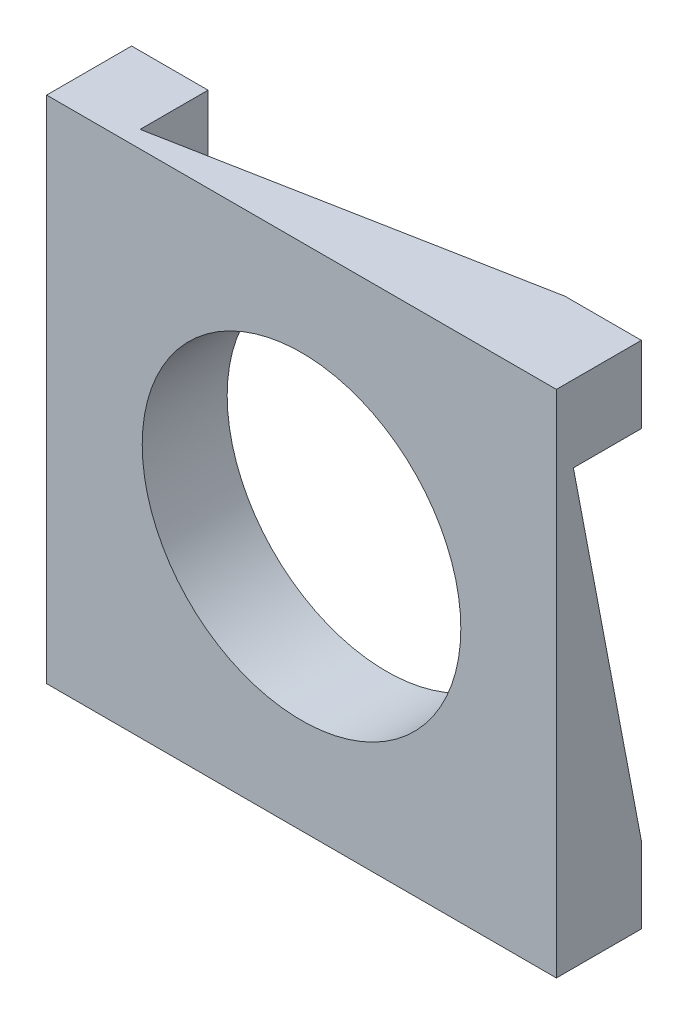
ISO-10303-21;
HEADER;
FILE_DESCRIPTION(('STEP AP214'),'2;1');
FILE_NAME('part.step','',(''),(''),'','','');
FILE_SCHEMA(('AUTOMOTIVE_DESIGN { 1 0 10303 214 1 1 1 1 }'));
ENDSEC;
DATA;
#1=APPLICATION_CONTEXT('core data for automotive mechanical design processes');
#2=APPLICATION_PROTOCOL_DEFINITION('international standard','automotive_design',2000,#1);
#3=PRODUCT_CONTEXT('',#1,'mechanical');
#4=PRODUCT('Part','Part','',(#3));
#5=PRODUCT_RELATED_PRODUCT_CATEGORY('part','',(#4));
#6=PRODUCT_DEFINITION_FORMATION('','',#4);
#7=PRODUCT_DEFINITION_CONTEXT('part definition',#1,'design');
#8=PRODUCT_DEFINITION('design','',#6,#7);
#9=PRODUCT_DEFINITION_SHAPE('','',#8);
#10=(LENGTH_UNIT() NAMED_UNIT(*) SI_UNIT(.MILLI.,.METRE.));
#11=(NAMED_UNIT(*) PLANE_ANGLE_UNIT() SI_UNIT($,.RADIAN.));
#12=(NAMED_UNIT(*) SI_UNIT($,.STERADIAN.) SOLID_ANGLE_UNIT());
#13=UNCERTAINTY_MEASURE_WITH_UNIT(LENGTH_MEASURE(1.E-05),#10,'distance_accuracy_value','');
#14=(GEOMETRIC_REPRESENTATION_CONTEXT(3) GLOBAL_UNCERTAINTY_ASSIGNED_CONTEXT((#13)) GLOBAL_UNIT_ASSIGNED_CONTEXT((#10,
#11,#12)) REPRESENTATION_CONTEXT('',''));
#15=CARTESIAN_POINT('',(0.,0.,0.));
#16=DIRECTION('',(0.,0.,1.));
#17=DIRECTION('',(1.,0.,0.));
#18=AXIS2_PLACEMENT_3D('',#15,#16,#17);
#19=CARTESIAN_POINT('',(0.,0.,0.));
#20=DIRECTION('',(0.,0.,1.));
#21=DIRECTION('',(1.,0.,0.));
#22=AXIS2_PLACEMENT_3D('',#19,#20,#21);
#23=PLANE('',#22);
#24=CARTESIAN_POINT('',(24.0473728456534,17.8594680542584,0.));
#25=DIRECTION('',(0.,0.,1.));
#26=DIRECTION('',(1.,0.,0.));
#27=AXIS2_PLACEMENT_3D('',#24,#25,#26);
#28=CIRCLE('',#27,187.5);
#29=CARTESIAN_POINT('',(211.547372845653,17.8594680542584,0.));
#30=VERTEX_POINT('',#29);
#31=EDGE_CURVE('E274',#30,#30,#28,.T.);
#32=ORIENTED_EDGE('',*,*,#31,.T.);
#33=EDGE_LOOP('',(#32));
#34=FACE_BOUND('',#33,.T.);
#35=DIRECTION('',(0.,1.,0.));
#36=VECTOR('',#35,1.);
#37=CARTESIAN_POINT('',(234.047372845653,237.859468054258,0.));
#38=LINE('',#37,#36);
#39=CARTESIAN_POINT('',(234.047372845653,237.859468054258,0.));
#40=VERTEX_POINT('',#39);
#41=CARTESIAN_POINT('',(234.047372845653,317.859468054258,0.));
#42=VERTEX_POINT('',#41);
#43=EDGE_CURVE('E162',#40,#42,#38,.T.);
#44=ORIENTED_EDGE('',*,*,#43,.T.);
#45=DIRECTION('',(-1.,0.,0.));
#46=VECTOR('',#45,1.);
#47=CARTESIAN_POINT('',(-275.952627154347,317.859468054258,0.));
#48=LINE('',#47,#46);
#49=CARTESIAN_POINT('',(324.047372845653,317.859468054258,0.));
#50=VERTEX_POINT('',#49);
#51=EDGE_CURVE('E309',#50,#42,#48,.T.);
#52=ORIENTED_EDGE('',*,*,#51,.F.);
#53=DIRECTION('',(0.,1.,0.));
#54=VECTOR('',#53,1.);
#55=CARTESIAN_POINT('',(324.047372845653,317.859468054258,0.));
#56=LINE('',#55,#54);
#57=CARTESIAN_POINT('',(324.047372845653,227.859468054258,0.));
#58=VERTEX_POINT('',#57);
#59=EDGE_CURVE('E285',#58,#50,#56,.T.);
#60=ORIENTED_EDGE('',*,*,#59,.F.);
#61=DIRECTION('',(1.,0.,0.));
#62=VECTOR('',#61,1.);
#63=CARTESIAN_POINT('',(244.047372845653,227.859468054258,0.));
#64=LINE('',#63,#62);
#65=CARTESIAN_POINT('',(244.047372845653,227.859468054258,0.));
#66=VERTEX_POINT('',#65);
#67=EDGE_CURVE('E69',#66,#58,#64,.T.);
#68=ORIENTED_EDGE('',*,*,#67,.F.);
#69=DIRECTION('',(0.,1.,0.));
#70=VECTOR('',#69,1.);
#71=CARTESIAN_POINT('',(244.047372845653,0.,0.));
#72=LINE('',#71,#70);
#73=CARTESIAN_POINT('',(244.047372845653,-192.140531945742,0.));
#74=VERTEX_POINT('',#73);
#75=EDGE_CURVE('E202',#74,#66,#72,.T.);
#76=ORIENTED_EDGE('',*,*,#75,.F.);
#77=DIRECTION('',(1.,0.,0.));
#78=VECTOR('',#77,1.);
#79=CARTESIAN_POINT('',(244.047372845653,-192.140531945742,0.));
#80=LINE('',#79,#78);
#81=CARTESIAN_POINT('',(324.047372845653,-192.140531945742,0.));
#82=VERTEX_POINT('',#81);
#83=EDGE_CURVE('E210',#74,#82,#80,.T.);
#84=ORIENTED_EDGE('',*,*,#83,.T.);
#85=CARTESIAN_POINT('',(324.047372845653,-282.140531945742,0.));
#86=VERTEX_POINT('',#85);
#87=EDGE_CURVE('E304',#86,#82,#56,.T.);
#88=ORIENTED_EDGE('',*,*,#87,.F.);
#89=DIRECTION('',(1.,0.,0.));
#90=VECTOR('',#89,1.);
#91=CARTESIAN_POINT('',(-275.952627154347,-282.140531945742,0.));
#92=LINE('',#91,#90);
#93=CARTESIAN_POINT('',(234.047372845653,-282.140531945742,0.));
#94=VERTEX_POINT('',#93);
#95=EDGE_CURVE('E317',#94,#86,#92,.T.);
#96=ORIENTED_EDGE('',*,*,#95,.F.);
#97=DIRECTION('',(0.,-1.,0.));
#98=VECTOR('',#97,1.);
#99=CARTESIAN_POINT('',(234.047372845653,-202.140531945742,0.));
#100=LINE('',#99,#98);
#101=CARTESIAN_POINT('',(234.047372845653,-202.140531945742,0.));
#102=VERTEX_POINT('',#101);
#103=EDGE_CURVE('E247',#102,#94,#100,.T.);
#104=ORIENTED_EDGE('',*,*,#103,.F.);
#105=DIRECTION('',(1.,0.,0.));
#106=VECTOR('',#105,1.);
#107=CARTESIAN_POINT('',(0.,-202.140531945742,0.));
#108=LINE('',#107,#106);
#109=CARTESIAN_POINT('',(-185.952627154347,-202.140531945742,0.));
#110=VERTEX_POINT('',#109);
#111=EDGE_CURVE('E228',#110,#102,#108,.T.);
#112=ORIENTED_EDGE('',*,*,#111,.F.);
#113=DIRECTION('',(0.,-1.,0.));
#114=VECTOR('',#113,1.);
#115=CARTESIAN_POINT('',(-185.952627154347,-202.140531945742,0.));
#116=LINE('',#115,#114);
#117=CARTESIAN_POINT('',(-185.952627154347,-282.140531945742,0.));
#118=VERTEX_POINT('',#117);
#119=EDGE_CURVE('E236',#110,#118,#116,.T.);
#120=ORIENTED_EDGE('',*,*,#119,.T.);
#121=CARTESIAN_POINT('',(-275.952627154347,-282.140531945742,0.));
#122=VERTEX_POINT('',#121);
#123=EDGE_CURVE('E294',#122,#118,#92,.T.);
#124=ORIENTED_EDGE('',*,*,#123,.F.);
#125=DIRECTION('',(0.,-1.,0.));
#126=VECTOR('',#125,1.);
#127=CARTESIAN_POINT('',(-275.952627154347,317.859468054258,0.));
#128=LINE('',#127,#126);
#129=CARTESIAN_POINT('',(-275.952627154347,-192.140531945742,0.));
#130=VERTEX_POINT('',#129);
#131=EDGE_CURVE('E312',#130,#122,#128,.T.);
#132=ORIENTED_EDGE('',*,*,#131,.F.);
#133=DIRECTION('',(-1.,0.,0.));
#134=VECTOR('',#133,1.);
#135=CARTESIAN_POINT('',(-195.952627154347,-192.140531945742,0.));
#136=LINE('',#135,#134);
#137=CARTESIAN_POINT('',(-195.952627154347,-192.140531945742,0.));
#138=VERTEX_POINT('',#137);
#139=EDGE_CURVE('E275',#138,#130,#136,.T.);
#140=ORIENTED_EDGE('',*,*,#139,.F.);
#141=DIRECTION('',(0.,-1.,0.));
#142=VECTOR('',#141,1.);
#143=CARTESIAN_POINT('',(-195.952627154347,0.,0.));
#144=LINE('',#143,#142);
#145=CARTESIAN_POINT('',(-195.952627154347,227.859468054258,0.));
#146=VERTEX_POINT('',#145);
#147=EDGE_CURVE('E256',#146,#138,#144,.T.);
#148=ORIENTED_EDGE('',*,*,#147,.F.);
#149=DIRECTION('',(-1.,0.,0.));
#150=VECTOR('',#149,1.);
#151=CARTESIAN_POINT('',(-195.952627154347,227.859468054258,0.));
#152=LINE('',#151,#150);
#153=CARTESIAN_POINT('',(-275.952627154347,227.859468054258,0.));
#154=VERTEX_POINT('',#153);
#155=EDGE_CURVE('E264',#146,#154,#152,.T.);
#156=ORIENTED_EDGE('',*,*,#155,.T.);
#157=CARTESIAN_POINT('',(-275.952627154347,317.859468054258,0.));
#158=VERTEX_POINT('',#157);
#159=EDGE_CURVE('E313',#158,#154,#128,.T.);
#160=ORIENTED_EDGE('',*,*,#159,.F.);
#161=CARTESIAN_POINT('',(-185.952627154347,317.859468054258,0.));
#162=VERTEX_POINT('',#161);
#163=EDGE_CURVE('E308',#162,#158,#48,.T.);
#164=ORIENTED_EDGE('',*,*,#163,.F.);
#165=DIRECTION('',(0.,1.,0.));
#166=VECTOR('',#165,1.);
#167=CARTESIAN_POINT('',(-185.952627154347,237.859468054258,0.));
#168=LINE('',#167,#166);
#169=CARTESIAN_POINT('',(-185.952627154347,237.859468054258,0.));
#170=VERTEX_POINT('',#169);
#171=EDGE_CURVE('E61',#170,#162,#168,.T.);
#172=ORIENTED_EDGE('',*,*,#171,.F.);
#173=DIRECTION('',(-1.,0.,0.));
#174=VECTOR('',#173,1.);
#175=CARTESIAN_POINT('',(0.,237.859468054258,0.));
#176=LINE('',#175,#174);
#177=EDGE_CURVE('E179',#40,#170,#176,.T.);
#178=ORIENTED_EDGE('',*,*,#177,.F.);
#179=EDGE_LOOP('',(#44,#52,#60,#68,#76,#84,#88,#96,#104,#112,#120,#124,#132,#140,#148,#156,#160,
#164,#172,#178));
#180=FACE_BOUND('',#179,.T.);
#181=ADVANCED_FACE('F45',(#34,#180),#23,.F.);
#182=CARTESIAN_POINT('',(-275.952627154347,317.859468054258,100.));
#183=DIRECTION('',(0.,-1.,0.));
#184=DIRECTION('',(0.,0.,-1.));
#185=AXIS2_PLACEMENT_3D('',#182,#183,#184);
#186=PLANE('',#185);
#187=DIRECTION('',(-0.982338566422475,0.,0.187112107889995));
#188=VECTOR('',#187,1.);
#189=CARTESIAN_POINT('',(8.19421874295504,317.859468054258,43.019648400514));
#190=LINE('',#189,#188);
#191=CARTESIAN_POINT('',(-185.952627154347,317.859468054258,80.));
#192=VERTEX_POINT('',#191);
#193=EDGE_CURVE('E168',#42,#192,#190,.T.);
#194=ORIENTED_EDGE('',*,*,#193,.T.);
#195=DIRECTION('',(0.,0.,1.));
#196=VECTOR('',#195,1.);
#197=CARTESIAN_POINT('',(-185.952627154347,317.859468054258,0.));
#198=LINE('',#197,#196);
#199=EDGE_CURVE('E181',#162,#192,#198,.T.);
#200=ORIENTED_EDGE('',*,*,#199,.F.);
#201=ORIENTED_EDGE('',*,*,#163,.T.);
#202=DIRECTION('',(0.,0.,-1.));
#203=VECTOR('',#202,1.);
#204=CARTESIAN_POINT('',(-275.952627154347,317.859468054258,100.));
#205=LINE('',#204,#203);
#206=CARTESIAN_POINT('',(-275.952627154347,317.859468054258,100.));
#207=VERTEX_POINT('',#206);
#208=EDGE_CURVE('E54',#207,#158,#205,.T.);
#209=ORIENTED_EDGE('',*,*,#208,.F.);
#210=DIRECTION('',(-1.,0.,0.));
#211=VECTOR('',#210,1.);
#212=CARTESIAN_POINT('',(-275.952627154347,317.859468054258,100.));
#213=LINE('',#212,#211);
#214=CARTESIAN_POINT('',(324.047372845653,317.859468054258,100.));
#215=VERTEX_POINT('',#214);
#216=EDGE_CURVE('E293',#215,#207,#213,.T.);
#217=ORIENTED_EDGE('',*,*,#216,.F.);
#218=DIRECTION('',(0.,0.,-1.));
#219=VECTOR('',#218,1.);
#220=CARTESIAN_POINT('',(324.047372845653,317.859468054258,100.));
#221=LINE('',#220,#219);
#222=EDGE_CURVE('E11',#215,#50,#221,.T.);
#223=ORIENTED_EDGE('',*,*,#222,.T.);
#224=ORIENTED_EDGE('',*,*,#51,.T.);
#225=EDGE_LOOP('',(#194,#200,#201,#209,#217,#223,#224));
#226=FACE_BOUND('',#225,.T.);
#227=ADVANCED_FACE('F358',(#226),#186,.F.);
#228=CARTESIAN_POINT('',(324.047372845653,317.859468054258,100.));
#229=DIRECTION('',(-1.,0.,0.));
#230=DIRECTION('',(0.,-1.,0.));
#231=AXIS2_PLACEMENT_3D('',#228,#229,#230);
#232=PLANE('',#231);
#233=DIRECTION('',(0.,0.982338566422475,0.187112107889995));
#234=VECTOR('',#233,1.);
#235=CARTESIAN_POINT('',(324.047372845653,-6.72702081210466,35.3168592635499));
#236=LINE('',#235,#234);
#237=CARTESIAN_POINT('',(324.047372845653,227.859468054258,80.));
#238=VERTEX_POINT('',#237);
#239=EDGE_CURVE('E196',#82,#238,#236,.T.);
#240=ORIENTED_EDGE('',*,*,#239,.T.);
#241=DIRECTION('',(0.,0.,1.));
#242=VECTOR('',#241,1.);
#243=CARTESIAN_POINT('',(324.047372845653,227.859468054258,0.));
#244=LINE('',#243,#242);
#245=EDGE_CURVE('E203',#58,#238,#244,.T.);
#246=ORIENTED_EDGE('',*,*,#245,.F.);
#247=ORIENTED_EDGE('',*,*,#59,.T.);
#248=ORIENTED_EDGE('',*,*,#222,.F.);
#249=DIRECTION('',(0.,1.,0.));
#250=VECTOR('',#249,1.);
#251=CARTESIAN_POINT('',(324.047372845653,317.859468054258,100.));
#252=LINE('',#251,#250);
#253=CARTESIAN_POINT('',(324.047372845653,-282.140531945742,100.));
#254=VERTEX_POINT('',#253);
#255=EDGE_CURVE('E289',#254,#215,#252,.T.);
#256=ORIENTED_EDGE('',*,*,#255,.F.);
#257=DIRECTION('',(0.,0.,-1.));
#258=VECTOR('',#257,1.);
#259=CARTESIAN_POINT('',(324.047372845653,-282.140531945742,100.));
#260=LINE('',#259,#258);
#261=EDGE_CURVE('E303',#254,#86,#260,.T.);
#262=ORIENTED_EDGE('',*,*,#261,.T.);
#263=ORIENTED_EDGE('',*,*,#87,.T.);
#264=EDGE_LOOP('',(#240,#246,#247,#248,#256,#262,#263));
#265=FACE_BOUND('',#264,.T.);
#266=ADVANCED_FACE('F47',(#265),#232,.F.);
#267=CARTESIAN_POINT('',(-275.952627154347,-282.140531945742,100.));
#268=DIRECTION('',(0.,1.,0.));
#269=DIRECTION('',(0.,0.,1.));
#270=AXIS2_PLACEMENT_3D('',#267,#268,#269);
#271=PLANE('',#270);
#272=DIRECTION('',(0.982338566422475,0.,0.187112107889995));
#273=VECTOR('',#272,1.);
#274=CARTESIAN_POINT('',(-6.51037644304058,-282.140531945742,34.1794763259631));
#275=LINE('',#274,#273);
#276=CARTESIAN_POINT('',(234.047372845653,-282.140531945742,80.));
#277=VERTEX_POINT('',#276);
#278=EDGE_CURVE('E219',#118,#277,#275,.T.);
#279=ORIENTED_EDGE('',*,*,#278,.T.);
#280=DIRECTION('',(0.,0.,1.));
#281=VECTOR('',#280,1.);
#282=CARTESIAN_POINT('',(234.047372845653,-282.140531945742,0.));
#283=LINE('',#282,#281);
#284=EDGE_CURVE('E229',#94,#277,#283,.T.);
#285=ORIENTED_EDGE('',*,*,#284,.F.);
#286=ORIENTED_EDGE('',*,*,#95,.T.);
#287=ORIENTED_EDGE('',*,*,#261,.F.);
#288=DIRECTION('',(1.,0.,0.));
#289=VECTOR('',#288,1.);
#290=CARTESIAN_POINT('',(-275.952627154347,-282.140531945742,100.));
#291=LINE('',#290,#289);
#292=CARTESIAN_POINT('',(-275.952627154347,-282.140531945742,100.));
#293=VERTEX_POINT('',#292);
#294=EDGE_CURVE('E300',#293,#254,#291,.T.);
#295=ORIENTED_EDGE('',*,*,#294,.F.);
#296=DIRECTION('',(0.,0.,-1.));
#297=VECTOR('',#296,1.);
#298=CARTESIAN_POINT('',(-275.952627154347,-282.140531945742,100.));
#299=LINE('',#298,#297);
#300=EDGE_CURVE('E324',#293,#122,#299,.T.);
#301=ORIENTED_EDGE('',*,*,#300,.T.);
#302=ORIENTED_EDGE('',*,*,#123,.T.);
#303=EDGE_LOOP('',(#279,#285,#286,#287,#295,#301,#302));
#304=FACE_BOUND('',#303,.T.);
#305=ADVANCED_FACE('F394',(#304),#271,.F.);
#306=CARTESIAN_POINT('',(-275.952627154347,317.859468054258,100.));
#307=DIRECTION('',(1.,0.,0.));
#308=DIRECTION('',(0.,1.,0.));
#309=AXIS2_PLACEMENT_3D('',#306,#307,#308);
#310=PLANE('',#309);
#311=DIRECTION('',(0.,-0.982338566422475,0.187112107889995));
#312=VECTOR('',#311,1.);
#313=CARTESIAN_POINT('',(-275.952627154347,7.97757437389083,41.8822654629272));
#314=LINE('',#313,#312);
#315=CARTESIAN_POINT('',(-275.952627154347,-192.140531945742,80.0000000000001));
#316=VERTEX_POINT('',#315);
#317=EDGE_CURVE('E246',#154,#316,#314,.T.);
#318=ORIENTED_EDGE('',*,*,#317,.T.);
#319=DIRECTION('',(0.,0.,1.));
#320=VECTOR('',#319,1.);
#321=CARTESIAN_POINT('',(-275.952627154347,-192.140531945742,0.));
#322=LINE('',#321,#320);
#323=EDGE_CURVE('E257',#130,#316,#322,.T.);
#324=ORIENTED_EDGE('',*,*,#323,.F.);
#325=ORIENTED_EDGE('',*,*,#131,.T.);
#326=ORIENTED_EDGE('',*,*,#300,.F.);
#327=DIRECTION('',(0.,-1.,0.));
#328=VECTOR('',#327,1.);
#329=CARTESIAN_POINT('',(-275.952627154347,317.859468054258,100.));
#330=LINE('',#329,#328);
#331=EDGE_CURVE('E297',#207,#293,#330,.T.);
#332=ORIENTED_EDGE('',*,*,#331,.F.);
#333=ORIENTED_EDGE('',*,*,#208,.T.);
#334=ORIENTED_EDGE('',*,*,#159,.T.);
#335=EDGE_LOOP('',(#318,#324,#325,#326,#332,#333,#334));
#336=FACE_BOUND('',#335,.T.);
#337=ADVANCED_FACE('F333',(#336),#310,.F.);
#338=CARTESIAN_POINT('',(0.,0.,100.));
#339=DIRECTION('',(0.,0.,1.));
#340=DIRECTION('',(1.,0.,0.));
#341=AXIS2_PLACEMENT_3D('',#338,#339,#340);
#342=PLANE('',#341);
#343=ORIENTED_EDGE('',*,*,#255,.T.);
#344=ORIENTED_EDGE('',*,*,#216,.T.);
#345=ORIENTED_EDGE('',*,*,#331,.T.);
#346=ORIENTED_EDGE('',*,*,#294,.T.);
#347=EDGE_LOOP('',(#343,#344,#345,#346));
#348=FACE_BOUND('',#347,.T.);
#349=CARTESIAN_POINT('',(24.0473728456534,17.8594680542584,100.));
#350=DIRECTION('',(0.,0.,1.));
#351=DIRECTION('',(1.,0.,0.));
#352=AXIS2_PLACEMENT_3D('',#349,#350,#351);
#353=CIRCLE('',#352,187.5);
#354=CARTESIAN_POINT('',(211.547372845653,17.8594680542584,100.));
#355=VERTEX_POINT('',#354);
#356=EDGE_CURVE('E281',#355,#355,#353,.T.);
#357=ORIENTED_EDGE('',*,*,#356,.F.);
#358=EDGE_LOOP('',(#357));
#359=FACE_BOUND('',#358,.T.);
#360=ADVANCED_FACE('F360',(#348,#359),#342,.T.);
#361=CARTESIAN_POINT('',(24.0473728456534,17.8594680542584,100.));
#362=DIRECTION('',(0.,0.,-1.));
#363=DIRECTION('',(-1.,0.,0.));
#364=AXIS2_PLACEMENT_3D('',#361,#362,#363);
#365=CYLINDRICAL_SURFACE('',#364,187.5);
#366=ORIENTED_EDGE('',*,*,#356,.T.);
#367=EDGE_LOOP('',(#366));
#368=FACE_BOUND('',#367,.T.);
#369=ORIENTED_EDGE('',*,*,#31,.F.);
#370=EDGE_LOOP('',(#369));
#371=FACE_BOUND('',#370,.T.);
#372=ADVANCED_FACE('F403',(#368,#371),#365,.F.);
#373=CARTESIAN_POINT('',(-195.952627154347,7.97757437389085,41.8822654629272));
#374=DIRECTION('',(0.,-0.187112107889995,-0.982338566422475));
#375=DIRECTION('',(0.,0.982338566422475,-0.187112107889995));
#376=AXIS2_PLACEMENT_3D('',#373,#374,#375);
#377=PLANE('',#376);
#378=ORIENTED_EDGE('',*,*,#317,.F.);
#379=ORIENTED_EDGE('',*,*,#155,.F.);
#380=DIRECTION('',(0.,-0.982338566422475,0.187112107889995));
#381=VECTOR('',#380,1.);
#382=CARTESIAN_POINT('',(-195.952627154347,7.97757437389085,41.8822654629272));
#383=LINE('',#382,#381);
#384=CARTESIAN_POINT('',(-195.952627154347,-192.140531945742,80.0000000000001));
#385=VERTEX_POINT('',#384);
#386=EDGE_CURVE('E253',#146,#385,#383,.T.);
#387=ORIENTED_EDGE('',*,*,#386,.T.);
#388=DIRECTION('',(-1.,0.,0.));
#389=VECTOR('',#388,1.);
#390=CARTESIAN_POINT('',(-195.952627154347,-192.140531945742,80.0000000000001));
#391=LINE('',#390,#389);
#392=EDGE_CURVE('E271',#385,#316,#391,.T.);
#393=ORIENTED_EDGE('',*,*,#392,.T.);
#394=EDGE_LOOP('',(#378,#379,#387,#393));
#395=FACE_BOUND('',#394,.T.);
#396=ADVANCED_FACE('F340',(#395),#377,.T.);
#397=CARTESIAN_POINT('',(-195.952627154347,-192.140531945742,0.));
#398=DIRECTION('',(0.,-1.,0.));
#399=DIRECTION('',(1.,0.,0.));
#400=AXIS2_PLACEMENT_3D('',#397,#398,#399);
#401=PLANE('',#400);
#402=ORIENTED_EDGE('',*,*,#323,.T.);
#403=ORIENTED_EDGE('',*,*,#392,.F.);
#404=DIRECTION('',(0.,0.,1.));
#405=VECTOR('',#404,1.);
#406=CARTESIAN_POINT('',(-195.952627154347,-192.140531945742,0.));
#407=LINE('',#406,#405);
#408=EDGE_CURVE('E260',#138,#385,#407,.T.);
#409=ORIENTED_EDGE('',*,*,#408,.F.);
#410=ORIENTED_EDGE('',*,*,#139,.T.);
#411=EDGE_LOOP('',(#402,#403,#409,#410));
#412=FACE_BOUND('',#411,.T.);
#413=ADVANCED_FACE('F346',(#412),#401,.F.);
#414=CARTESIAN_POINT('',(-195.952627154347,0.,0.));
#415=DIRECTION('',(-1.,0.,0.));
#416=DIRECTION('',(0.,-1.,0.));
#417=AXIS2_PLACEMENT_3D('',#414,#415,#416);
#418=PLANE('',#417);
#419=ORIENTED_EDGE('',*,*,#386,.F.);
#420=ORIENTED_EDGE('',*,*,#147,.T.);
#421=ORIENTED_EDGE('',*,*,#408,.T.);
#422=EDGE_LOOP('',(#419,#420,#421));
#423=FACE_BOUND('',#422,.T.);
#424=ADVANCED_FACE('F343',(#423),#418,.T.);
#425=CARTESIAN_POINT('',(-6.51037644304058,-202.140531945742,34.1794763259631));
#426=DIRECTION('',(0.187112107889995,0.,-0.982338566422475));
#427=DIRECTION('',(-0.982338566422475,0.,-0.187112107889995));
#428=AXIS2_PLACEMENT_3D('',#425,#426,#427);
#429=PLANE('',#428);
#430=ORIENTED_EDGE('',*,*,#278,.F.);
#431=ORIENTED_EDGE('',*,*,#119,.F.);
#432=DIRECTION('',(0.982338566422475,0.,0.187112107889995));
#433=VECTOR('',#432,1.);
#434=CARTESIAN_POINT('',(-6.51037644304058,-202.140531945742,34.1794763259631));
#435=LINE('',#434,#433);
#436=CARTESIAN_POINT('',(234.047372845653,-202.140531945742,80.));
#437=VERTEX_POINT('',#436);
#438=EDGE_CURVE('E225',#110,#437,#435,.T.);
#439=ORIENTED_EDGE('',*,*,#438,.T.);
#440=DIRECTION('',(0.,-1.,0.));
#441=VECTOR('',#440,1.);
#442=CARTESIAN_POINT('',(234.047372845653,-202.140531945742,80.));
#443=LINE('',#442,#441);
#444=EDGE_CURVE('E243',#437,#277,#443,.T.);
#445=ORIENTED_EDGE('',*,*,#444,.T.);
#446=EDGE_LOOP('',(#430,#431,#439,#445));
#447=FACE_BOUND('',#446,.T.);
#448=ADVANCED_FACE('F416',(#447),#429,.T.);
#449=CARTESIAN_POINT('',(234.047372845653,-202.140531945742,0.));
#450=DIRECTION('',(1.,0.,0.));
#451=DIRECTION('',(0.,0.,-1.));
#452=AXIS2_PLACEMENT_3D('',#449,#450,#451);
#453=PLANE('',#452);
#454=ORIENTED_EDGE('',*,*,#284,.T.);
#455=ORIENTED_EDGE('',*,*,#444,.F.);
#456=DIRECTION('',(0.,0.,1.));
#457=VECTOR('',#456,1.);
#458=CARTESIAN_POINT('',(234.047372845653,-202.140531945742,0.));
#459=LINE('',#458,#457);
#460=EDGE_CURVE('E232',#102,#437,#459,.T.);
#461=ORIENTED_EDGE('',*,*,#460,.F.);
#462=ORIENTED_EDGE('',*,*,#103,.T.);
#463=EDGE_LOOP('',(#454,#455,#461,#462));
#464=FACE_BOUND('',#463,.T.);
#465=ADVANCED_FACE('F419',(#464),#453,.F.);
#466=CARTESIAN_POINT('',(0.,-202.140531945742,0.));
#467=DIRECTION('',(0.,-1.,0.));
#468=DIRECTION('',(0.,0.,-1.));
#469=AXIS2_PLACEMENT_3D('',#466,#467,#468);
#470=PLANE('',#469);
#471=ORIENTED_EDGE('',*,*,#438,.F.);
#472=ORIENTED_EDGE('',*,*,#111,.T.);
#473=ORIENTED_EDGE('',*,*,#460,.T.);
#474=EDGE_LOOP('',(#471,#472,#473));
#475=FACE_BOUND('',#474,.T.);
#476=ADVANCED_FACE('F383',(#475),#470,.T.);
#477=CARTESIAN_POINT('',(244.047372845653,-6.72702081210468,35.3168592635499));
#478=DIRECTION('',(0.,0.187112107889995,-0.982338566422475));
#479=DIRECTION('',(0.,0.982338566422475,0.187112107889995));
#480=AXIS2_PLACEMENT_3D('',#477,#478,#479);
#481=PLANE('',#480);
#482=ORIENTED_EDGE('',*,*,#239,.F.);
#483=ORIENTED_EDGE('',*,*,#83,.F.);
#484=DIRECTION('',(0.,0.982338566422475,0.187112107889995));
#485=VECTOR('',#484,1.);
#486=CARTESIAN_POINT('',(244.047372845653,-6.72702081210468,35.3168592635499));
#487=LINE('',#486,#485);
#488=CARTESIAN_POINT('',(244.047372845653,227.859468054258,80.));
#489=VERTEX_POINT('',#488);
#490=EDGE_CURVE('E199',#74,#489,#487,.T.);
#491=ORIENTED_EDGE('',*,*,#490,.T.);
#492=DIRECTION('',(1.,0.,0.));
#493=VECTOR('',#492,1.);
#494=CARTESIAN_POINT('',(244.047372845653,227.859468054258,80.));
#495=LINE('',#494,#493);
#496=EDGE_CURVE('E216',#489,#238,#495,.T.);
#497=ORIENTED_EDGE('',*,*,#496,.T.);
#498=EDGE_LOOP('',(#482,#483,#491,#497));
#499=FACE_BOUND('',#498,.T.);
#500=ADVANCED_FACE('F371',(#499),#481,.T.);
#501=CARTESIAN_POINT('',(244.047372845653,227.859468054258,0.));
#502=DIRECTION('',(0.,1.,0.));
#503=DIRECTION('',(0.,0.,1.));
#504=AXIS2_PLACEMENT_3D('',#501,#502,#503);
#505=PLANE('',#504);
#506=ORIENTED_EDGE('',*,*,#245,.T.);
#507=ORIENTED_EDGE('',*,*,#496,.F.);
#508=DIRECTION('',(0.,0.,1.));
#509=VECTOR('',#508,1.);
#510=CARTESIAN_POINT('',(244.047372845653,227.859468054258,0.));
#511=LINE('',#510,#509);
#512=EDGE_CURVE('E206',#66,#489,#511,.T.);
#513=ORIENTED_EDGE('',*,*,#512,.F.);
#514=ORIENTED_EDGE('',*,*,#67,.T.);
#515=EDGE_LOOP('',(#506,#507,#513,#514));
#516=FACE_BOUND('',#515,.T.);
#517=ADVANCED_FACE('F375',(#516),#505,.F.);
#518=CARTESIAN_POINT('',(244.047372845653,0.,0.));
#519=DIRECTION('',(1.,0.,0.));
#520=DIRECTION('',(0.,1.,0.));
#521=AXIS2_PLACEMENT_3D('',#518,#519,#520);
#522=PLANE('',#521);
#523=ORIENTED_EDGE('',*,*,#490,.F.);
#524=ORIENTED_EDGE('',*,*,#75,.T.);
#525=ORIENTED_EDGE('',*,*,#512,.T.);
#526=EDGE_LOOP('',(#523,#524,#525));
#527=FACE_BOUND('',#526,.T.);
#528=ADVANCED_FACE('F374',(#527),#522,.T.);
#529=CARTESIAN_POINT('',(8.19421874295504,237.859468054258,43.019648400514));
#530=DIRECTION('',(-0.187112107889995,0.,-0.982338566422475));
#531=DIRECTION('',(-0.982338566422475,0.,0.187112107889995));
#532=AXIS2_PLACEMENT_3D('',#529,#530,#531);
#533=PLANE('',#532);
#534=ORIENTED_EDGE('',*,*,#193,.F.);
#535=ORIENTED_EDGE('',*,*,#43,.F.);
#536=DIRECTION('',(-0.982338566422475,0.,0.187112107889995));
#537=VECTOR('',#536,1.);
#538=CARTESIAN_POINT('',(8.19421874295504,237.859468054258,43.019648400514));
#539=LINE('',#538,#537);
#540=CARTESIAN_POINT('',(-185.952627154347,237.859468054258,80.));
#541=VERTEX_POINT('',#540);
#542=EDGE_CURVE('E165',#40,#541,#539,.T.);
#543=ORIENTED_EDGE('',*,*,#542,.T.);
#544=DIRECTION('',(0.,1.,0.));
#545=VECTOR('',#544,1.);
#546=CARTESIAN_POINT('',(-185.952627154347,237.859468054258,80.));
#547=LINE('',#546,#545);
#548=EDGE_CURVE('E193',#541,#192,#547,.T.);
#549=ORIENTED_EDGE('',*,*,#548,.T.);
#550=EDGE_LOOP('',(#534,#535,#543,#549));
#551=FACE_BOUND('',#550,.T.);
#552=ADVANCED_FACE('F164',(#551),#533,.T.);
#553=CARTESIAN_POINT('',(-185.952627154347,237.859468054258,0.));
#554=DIRECTION('',(-1.,0.,0.));
#555=DIRECTION('',(0.,0.,1.));
#556=AXIS2_PLACEMENT_3D('',#553,#554,#555);
#557=PLANE('',#556);
#558=ORIENTED_EDGE('',*,*,#199,.T.);
#559=ORIENTED_EDGE('',*,*,#548,.F.);
#560=DIRECTION('',(0.,0.,1.));
#561=VECTOR('',#560,1.);
#562=CARTESIAN_POINT('',(-185.952627154347,237.859468054258,0.));
#563=LINE('',#562,#561);
#564=EDGE_CURVE('E174',#170,#541,#563,.T.);
#565=ORIENTED_EDGE('',*,*,#564,.F.);
#566=ORIENTED_EDGE('',*,*,#171,.T.);
#567=EDGE_LOOP('',(#558,#559,#565,#566));
#568=FACE_BOUND('',#567,.T.);
#569=ADVANCED_FACE('F476',(#568),#557,.F.);
#570=CARTESIAN_POINT('',(0.,237.859468054258,0.));
#571=DIRECTION('',(0.,1.,0.));
#572=DIRECTION('',(0.,0.,1.));
#573=AXIS2_PLACEMENT_3D('',#570,#571,#572);
#574=PLANE('',#573);
#575=ORIENTED_EDGE('',*,*,#542,.F.);
#576=ORIENTED_EDGE('',*,*,#177,.T.);
#577=ORIENTED_EDGE('',*,*,#564,.T.);
#578=EDGE_LOOP('',(#575,#576,#577));
#579=FACE_BOUND('',#578,.T.);
#580=ADVANCED_FACE('F178',(#579),#574,.T.);
#581=CLOSED_SHELL('',(#181,#227,#266,#305,#337,#360,#372,#396,#413,#424,#448,#465,#476,#500,
#517,#528,#552,#569,#580));
#582=MANIFOLD_SOLID_BREP('B2',#581);
#583=ADVANCED_BREP_SHAPE_REPRESENTATION('',(#18,#582),#14);
#584=SHAPE_DEFINITION_REPRESENTATION(#9,#583);
ENDSEC;
END-ISO-10303-21;
